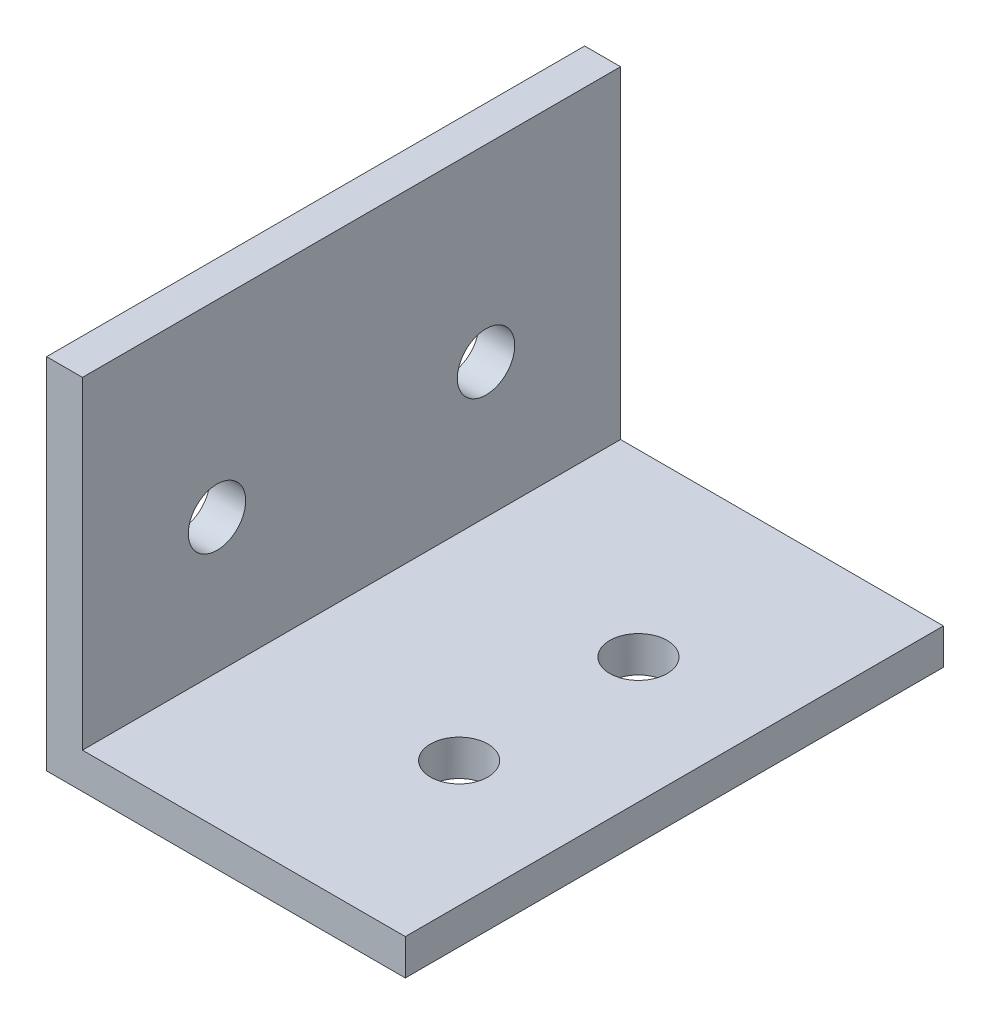
ISO-10303-21;
HEADER;
FILE_DESCRIPTION(('STEP AP214'),'2;1');
FILE_NAME('part.step','',(''),(''),'','','');
FILE_SCHEMA(('AUTOMOTIVE_DESIGN { 1 0 10303 214 1 1 1 1 }'));
ENDSEC;
DATA;
#1=APPLICATION_CONTEXT('core data for automotive mechanical design processes');
#2=APPLICATION_PROTOCOL_DEFINITION('international standard','automotive_design',2000,#1);
#3=PRODUCT_CONTEXT('',#1,'mechanical');
#4=PRODUCT('Part','Part','',(#3));
#5=PRODUCT_RELATED_PRODUCT_CATEGORY('part','',(#4));
#6=PRODUCT_DEFINITION_FORMATION('','',#4);
#7=PRODUCT_DEFINITION_CONTEXT('part definition',#1,'design');
#8=PRODUCT_DEFINITION('design','',#6,#7);
#9=PRODUCT_DEFINITION_SHAPE('','',#8);
#10=(LENGTH_UNIT() NAMED_UNIT(*) SI_UNIT(.MILLI.,.METRE.));
#11=(NAMED_UNIT(*) PLANE_ANGLE_UNIT() SI_UNIT($,.RADIAN.));
#12=(NAMED_UNIT(*) SI_UNIT($,.STERADIAN.) SOLID_ANGLE_UNIT());
#13=UNCERTAINTY_MEASURE_WITH_UNIT(LENGTH_MEASURE(1.E-05),#10,'distance_accuracy_value','');
#14=(GEOMETRIC_REPRESENTATION_CONTEXT(3) GLOBAL_UNCERTAINTY_ASSIGNED_CONTEXT((#13)) GLOBAL_UNIT_ASSIGNED_CONTEXT((#10,
#11,#12)) REPRESENTATION_CONTEXT('',''));
#15=CARTESIAN_POINT('',(0.,0.,0.));
#16=DIRECTION('',(0.,0.,1.));
#17=DIRECTION('',(1.,0.,0.));
#18=AXIS2_PLACEMENT_3D('',#15,#16,#17);
#19=CARTESIAN_POINT('',(0.,20.,30.));
#20=DIRECTION('',(0.,-1.,0.));
#21=DIRECTION('',(0.,0.,-1.));
#22=AXIS2_PLACEMENT_3D('',#19,#20,#21);
#23=PLANE('',#22);
#24=DIRECTION('',(-1.,0.,0.));
#25=VECTOR('',#24,1.);
#26=CARTESIAN_POINT('',(0.,20.,0.));
#27=LINE('',#26,#25);
#28=CARTESIAN_POINT('',(2.,20.,0.));
#29=VERTEX_POINT('',#28);
#30=CARTESIAN_POINT('',(0.,20.,0.));
#31=VERTEX_POINT('',#30);
#32=EDGE_CURVE('E119',#29,#31,#27,.T.);
#33=ORIENTED_EDGE('',*,*,#32,.T.);
#34=DIRECTION('',(0.,0.,-1.));
#35=VECTOR('',#34,1.);
#36=CARTESIAN_POINT('',(0.,20.,30.));
#37=LINE('',#36,#35);
#38=CARTESIAN_POINT('',(0.,20.,30.));
#39=VERTEX_POINT('',#38);
#40=EDGE_CURVE('E11',#39,#31,#37,.T.);
#41=ORIENTED_EDGE('',*,*,#40,.F.);
#42=DIRECTION('',(-1.,0.,0.));
#43=VECTOR('',#42,1.);
#44=CARTESIAN_POINT('',(0.,20.,30.));
#45=LINE('',#44,#43);
#46=CARTESIAN_POINT('',(2.,20.,30.));
#47=VERTEX_POINT('',#46);
#48=EDGE_CURVE('E130',#47,#39,#45,.T.);
#49=ORIENTED_EDGE('',*,*,#48,.F.);
#50=DIRECTION('',(0.,0.,-1.));
#51=VECTOR('',#50,1.);
#52=CARTESIAN_POINT('',(2.,20.,30.));
#53=LINE('',#52,#51);
#54=EDGE_CURVE('E115',#47,#29,#53,.T.);
#55=ORIENTED_EDGE('',*,*,#54,.T.);
#56=EDGE_LOOP('',(#33,#41,#49,#55));
#57=FACE_BOUND('',#56,.T.);
#58=ADVANCED_FACE('F33',(#57),#23,.F.);
#59=CARTESIAN_POINT('',(0.,20.,30.));
#60=DIRECTION('',(1.,0.,0.));
#61=DIRECTION('',(0.,1.,0.));
#62=AXIS2_PLACEMENT_3D('',#59,#60,#61);
#63=PLANE('',#62);
#64=CARTESIAN_POINT('',(0.,9.5,7.5));
#65=DIRECTION('',(1.,0.,0.));
#66=DIRECTION('',(0.,0.,-1.));
#67=AXIS2_PLACEMENT_3D('',#64,#65,#66);
#68=CIRCLE('',#67,1.6);
#69=CARTESIAN_POINT('',(0.,9.5,5.9));
#70=VERTEX_POINT('',#69);
#71=EDGE_CURVE('E141',#70,#70,#68,.T.);
#72=ORIENTED_EDGE('',*,*,#71,.T.);
#73=EDGE_LOOP('',(#72));
#74=FACE_BOUND('',#73,.T.);
#75=CARTESIAN_POINT('',(0.,9.5,22.5));
#76=DIRECTION('',(1.,0.,0.));
#77=DIRECTION('',(0.,0.,-1.));
#78=AXIS2_PLACEMENT_3D('',#75,#76,#77);
#79=CIRCLE('',#78,1.6);
#80=CARTESIAN_POINT('',(0.,9.5,20.9));
#81=VERTEX_POINT('',#80);
#82=EDGE_CURVE('E138',#81,#81,#79,.T.);
#83=ORIENTED_EDGE('',*,*,#82,.T.);
#84=EDGE_LOOP('',(#83));
#85=FACE_BOUND('',#84,.T.);
#86=DIRECTION('',(0.,-1.,0.));
#87=VECTOR('',#86,1.);
#88=CARTESIAN_POINT('',(0.,20.,0.));
#89=LINE('',#88,#87);
#90=CARTESIAN_POINT('',(0.,0.,0.));
#91=VERTEX_POINT('',#90);
#92=EDGE_CURVE('E122',#31,#91,#89,.T.);
#93=ORIENTED_EDGE('',*,*,#92,.T.);
#94=DIRECTION('',(0.,0.,-1.));
#95=VECTOR('',#94,1.);
#96=CARTESIAN_POINT('',(0.,0.,30.));
#97=LINE('',#96,#95);
#98=CARTESIAN_POINT('',(0.,0.,30.));
#99=VERTEX_POINT('',#98);
#100=EDGE_CURVE('E42',#99,#91,#97,.T.);
#101=ORIENTED_EDGE('',*,*,#100,.F.);
#102=DIRECTION('',(0.,-1.,0.));
#103=VECTOR('',#102,1.);
#104=CARTESIAN_POINT('',(0.,20.,30.));
#105=LINE('',#104,#103);
#106=EDGE_CURVE('E88',#39,#99,#105,.T.);
#107=ORIENTED_EDGE('',*,*,#106,.F.);
#108=ORIENTED_EDGE('',*,*,#40,.T.);
#109=EDGE_LOOP('',(#93,#101,#107,#108));
#110=FACE_BOUND('',#109,.T.);
#111=ADVANCED_FACE('F162',(#74,#85,#110),#63,.F.);
#112=CARTESIAN_POINT('',(0.,0.,30.));
#113=DIRECTION('',(0.,1.,0.));
#114=DIRECTION('',(0.,0.,1.));
#115=AXIS2_PLACEMENT_3D('',#112,#113,#114);
#116=PLANE('',#115);
#117=CARTESIAN_POINT('',(13.,0.,20.));
#118=DIRECTION('',(0.,1.,0.));
#119=DIRECTION('',(0.,0.,1.));
#120=AXIS2_PLACEMENT_3D('',#117,#118,#119);
#121=CIRCLE('',#120,1.6);
#122=CARTESIAN_POINT('',(13.,0.,21.6));
#123=VERTEX_POINT('',#122);
#124=EDGE_CURVE('E154',#123,#123,#121,.T.);
#125=ORIENTED_EDGE('',*,*,#124,.T.);
#126=EDGE_LOOP('',(#125));
#127=FACE_BOUND('',#126,.T.);
#128=CARTESIAN_POINT('',(13.,0.,10.));
#129=DIRECTION('',(0.,1.,0.));
#130=DIRECTION('',(0.,0.,1.));
#131=AXIS2_PLACEMENT_3D('',#128,#129,#130);
#132=CIRCLE('',#131,1.6);
#133=CARTESIAN_POINT('',(13.,0.,11.6));
#134=VERTEX_POINT('',#133);
#135=EDGE_CURVE('E144',#134,#134,#132,.T.);
#136=ORIENTED_EDGE('',*,*,#135,.T.);
#137=EDGE_LOOP('',(#136));
#138=FACE_BOUND('',#137,.T.);
#139=DIRECTION('',(1.,0.,0.));
#140=VECTOR('',#139,1.);
#141=CARTESIAN_POINT('',(0.,0.,0.));
#142=LINE('',#141,#140);
#143=CARTESIAN_POINT('',(20.,0.,0.));
#144=VERTEX_POINT('',#143);
#145=EDGE_CURVE('E125',#91,#144,#142,.T.);
#146=ORIENTED_EDGE('',*,*,#145,.T.);
#147=DIRECTION('',(0.,0.,-1.));
#148=VECTOR('',#147,1.);
#149=CARTESIAN_POINT('',(20.,0.,30.));
#150=LINE('',#149,#148);
#151=CARTESIAN_POINT('',(20.,0.,30.));
#152=VERTEX_POINT('',#151);
#153=EDGE_CURVE('E110',#152,#144,#150,.T.);
#154=ORIENTED_EDGE('',*,*,#153,.F.);
#155=DIRECTION('',(1.,0.,0.));
#156=VECTOR('',#155,1.);
#157=CARTESIAN_POINT('',(0.,0.,30.));
#158=LINE('',#157,#156);
#159=EDGE_CURVE('E101',#99,#152,#158,.T.);
#160=ORIENTED_EDGE('',*,*,#159,.F.);
#161=ORIENTED_EDGE('',*,*,#100,.T.);
#162=EDGE_LOOP('',(#146,#154,#160,#161));
#163=FACE_BOUND('',#162,.T.);
#164=ADVANCED_FACE('F165',(#127,#138,#163),#116,.F.);
#165=CARTESIAN_POINT('',(20.,2.,30.));
#166=DIRECTION('',(-1.,0.,0.));
#167=DIRECTION('',(0.,0.,1.));
#168=AXIS2_PLACEMENT_3D('',#165,#166,#167);
#169=PLANE('',#168);
#170=DIRECTION('',(0.,1.,0.));
#171=VECTOR('',#170,1.);
#172=CARTESIAN_POINT('',(20.,2.,0.));
#173=LINE('',#172,#171);
#174=CARTESIAN_POINT('',(20.,2.,0.));
#175=VERTEX_POINT('',#174);
#176=EDGE_CURVE('E109',#144,#175,#173,.T.);
#177=ORIENTED_EDGE('',*,*,#176,.T.);
#178=DIRECTION('',(0.,0.,-1.));
#179=VECTOR('',#178,1.);
#180=CARTESIAN_POINT('',(20.,2.,30.));
#181=LINE('',#180,#179);
#182=CARTESIAN_POINT('',(20.,2.,30.));
#183=VERTEX_POINT('',#182);
#184=EDGE_CURVE('E106',#183,#175,#181,.T.);
#185=ORIENTED_EDGE('',*,*,#184,.F.);
#186=DIRECTION('',(0.,1.,0.));
#187=VECTOR('',#186,1.);
#188=CARTESIAN_POINT('',(20.,2.,30.));
#189=LINE('',#188,#187);
#190=EDGE_CURVE('E95',#152,#183,#189,.T.);
#191=ORIENTED_EDGE('',*,*,#190,.F.);
#192=ORIENTED_EDGE('',*,*,#153,.T.);
#193=EDGE_LOOP('',(#177,#185,#191,#192));
#194=FACE_BOUND('',#193,.T.);
#195=ADVANCED_FACE('F107',(#194),#169,.F.);
#196=CARTESIAN_POINT('',(2.,2.,30.));
#197=DIRECTION('',(0.,-1.,0.));
#198=DIRECTION('',(0.,0.,-1.));
#199=AXIS2_PLACEMENT_3D('',#196,#197,#198);
#200=PLANE('',#199);
#201=CARTESIAN_POINT('',(13.,2.,20.));
#202=DIRECTION('',(0.,-1.,0.));
#203=DIRECTION('',(0.,0.,-1.));
#204=AXIS2_PLACEMENT_3D('',#201,#202,#203);
#205=CIRCLE('',#204,1.6);
#206=CARTESIAN_POINT('',(13.,2.,18.4));
#207=VERTEX_POINT('',#206);
#208=EDGE_CURVE('E36',#207,#207,#205,.F.);
#209=ORIENTED_EDGE('',*,*,#208,.F.);
#210=EDGE_LOOP('',(#209));
#211=FACE_BOUND('',#210,.T.);
#212=CARTESIAN_POINT('',(13.,2.,10.));
#213=DIRECTION('',(0.,-1.,0.));
#214=DIRECTION('',(0.,0.,-1.));
#215=AXIS2_PLACEMENT_3D('',#212,#213,#214);
#216=CIRCLE('',#215,1.6);
#217=CARTESIAN_POINT('',(13.,2.,8.4));
#218=VERTEX_POINT('',#217);
#219=EDGE_CURVE('E142',#218,#218,#216,.F.);
#220=ORIENTED_EDGE('',*,*,#219,.F.);
#221=EDGE_LOOP('',(#220));
#222=FACE_BOUND('',#221,.T.);
#223=DIRECTION('',(-1.,0.,0.));
#224=VECTOR('',#223,1.);
#225=CARTESIAN_POINT('',(2.,2.,0.));
#226=LINE('',#225,#224);
#227=CARTESIAN_POINT('',(2.,2.,0.));
#228=VERTEX_POINT('',#227);
#229=EDGE_CURVE('E74',#175,#228,#226,.T.);
#230=ORIENTED_EDGE('',*,*,#229,.T.);
#231=DIRECTION('',(0.,0.,-1.));
#232=VECTOR('',#231,1.);
#233=CARTESIAN_POINT('',(2.,2.,30.));
#234=LINE('',#233,#232);
#235=CARTESIAN_POINT('',(2.,2.,30.));
#236=VERTEX_POINT('',#235);
#237=EDGE_CURVE('E111',#236,#228,#234,.T.);
#238=ORIENTED_EDGE('',*,*,#237,.F.);
#239=DIRECTION('',(-1.,0.,0.));
#240=VECTOR('',#239,1.);
#241=CARTESIAN_POINT('',(2.,2.,30.));
#242=LINE('',#241,#240);
#243=EDGE_CURVE('E99',#183,#236,#242,.T.);
#244=ORIENTED_EDGE('',*,*,#243,.F.);
#245=ORIENTED_EDGE('',*,*,#184,.T.);
#246=EDGE_LOOP('',(#230,#238,#244,#245));
#247=FACE_BOUND('',#246,.T.);
#248=ADVANCED_FACE('F113',(#211,#222,#247),#200,.F.);
#249=CARTESIAN_POINT('',(2.,20.,30.));
#250=DIRECTION('',(-1.,0.,0.));
#251=DIRECTION('',(0.,-1.,0.));
#252=AXIS2_PLACEMENT_3D('',#249,#250,#251);
#253=PLANE('',#252);
#254=CARTESIAN_POINT('',(2.,9.5,7.5));
#255=DIRECTION('',(-1.,0.,0.));
#256=DIRECTION('',(0.,-1.,0.));
#257=AXIS2_PLACEMENT_3D('',#254,#255,#256);
#258=CIRCLE('',#257,1.6);
#259=CARTESIAN_POINT('',(2.,7.9,7.5));
#260=VERTEX_POINT('',#259);
#261=EDGE_CURVE('E139',#260,#260,#258,.F.);
#262=ORIENTED_EDGE('',*,*,#261,.F.);
#263=EDGE_LOOP('',(#262));
#264=FACE_BOUND('',#263,.T.);
#265=CARTESIAN_POINT('',(2.,9.5,22.5));
#266=DIRECTION('',(-1.,0.,0.));
#267=DIRECTION('',(0.,-1.,0.));
#268=AXIS2_PLACEMENT_3D('',#265,#266,#267);
#269=CIRCLE('',#268,1.6);
#270=CARTESIAN_POINT('',(2.,7.9,22.5));
#271=VERTEX_POINT('',#270);
#272=EDGE_CURVE('E123',#271,#271,#269,.F.);
#273=ORIENTED_EDGE('',*,*,#272,.F.);
#274=EDGE_LOOP('',(#273));
#275=FACE_BOUND('',#274,.T.);
#276=DIRECTION('',(0.,1.,0.));
#277=VECTOR('',#276,1.);
#278=CARTESIAN_POINT('',(2.,20.,0.));
#279=LINE('',#278,#277);
#280=EDGE_CURVE('E80',#228,#29,#279,.T.);
#281=ORIENTED_EDGE('',*,*,#280,.T.);
#282=ORIENTED_EDGE('',*,*,#54,.F.);
#283=DIRECTION('',(0.,1.,0.));
#284=VECTOR('',#283,1.);
#285=CARTESIAN_POINT('',(2.,20.,30.));
#286=LINE('',#285,#284);
#287=EDGE_CURVE('E51',#236,#47,#286,.T.);
#288=ORIENTED_EDGE('',*,*,#287,.F.);
#289=ORIENTED_EDGE('',*,*,#237,.T.);
#290=EDGE_LOOP('',(#281,#282,#288,#289));
#291=FACE_BOUND('',#290,.T.);
#292=ADVANCED_FACE('F170',(#264,#275,#291),#253,.F.);
#293=CARTESIAN_POINT('',(0.,0.,30.));
#294=DIRECTION('',(0.,0.,-1.));
#295=DIRECTION('',(-1.,0.,0.));
#296=AXIS2_PLACEMENT_3D('',#293,#294,#295);
#297=PLANE('',#296);
#298=ORIENTED_EDGE('',*,*,#48,.T.);
#299=ORIENTED_EDGE('',*,*,#106,.T.);
#300=ORIENTED_EDGE('',*,*,#159,.T.);
#301=ORIENTED_EDGE('',*,*,#190,.T.);
#302=ORIENTED_EDGE('',*,*,#243,.T.);
#303=ORIENTED_EDGE('',*,*,#287,.T.);
#304=EDGE_LOOP('',(#298,#299,#300,#301,#302,#303));
#305=FACE_BOUND('',#304,.T.);
#306=ADVANCED_FACE('F97',(#305),#297,.F.);
#307=CARTESIAN_POINT('',(0.,0.,0.));
#308=DIRECTION('',(0.,0.,-1.));
#309=DIRECTION('',(-1.,0.,0.));
#310=AXIS2_PLACEMENT_3D('',#307,#308,#309);
#311=PLANE('',#310);
#312=ORIENTED_EDGE('',*,*,#32,.F.);
#313=ORIENTED_EDGE('',*,*,#280,.F.);
#314=ORIENTED_EDGE('',*,*,#229,.F.);
#315=ORIENTED_EDGE('',*,*,#176,.F.);
#316=ORIENTED_EDGE('',*,*,#145,.F.);
#317=ORIENTED_EDGE('',*,*,#92,.F.);
#318=EDGE_LOOP('',(#312,#313,#314,#315,#316,#317));
#319=FACE_BOUND('',#318,.T.);
#320=ADVANCED_FACE('F168',(#319),#311,.T.);
#321=CARTESIAN_POINT('',(10.,9.5,22.5));
#322=DIRECTION('',(-1.,0.,0.));
#323=DIRECTION('',(0.,0.,1.));
#324=AXIS2_PLACEMENT_3D('',#321,#322,#323);
#325=CYLINDRICAL_SURFACE('',#324,1.6);
#326=ORIENTED_EDGE('',*,*,#82,.F.);
#327=EDGE_LOOP('',(#326));
#328=FACE_BOUND('',#327,.T.);
#329=ORIENTED_EDGE('',*,*,#272,.T.);
#330=EDGE_LOOP('',(#329));
#331=FACE_BOUND('',#330,.T.);
#332=ADVANCED_FACE('F241',(#328,#331),#325,.F.);
#333=CARTESIAN_POINT('',(10.,9.5,7.5));
#334=DIRECTION('',(-1.,0.,0.));
#335=DIRECTION('',(0.,0.,1.));
#336=AXIS2_PLACEMENT_3D('',#333,#334,#335);
#337=CYLINDRICAL_SURFACE('',#336,1.6);
#338=ORIENTED_EDGE('',*,*,#71,.F.);
#339=EDGE_LOOP('',(#338));
#340=FACE_BOUND('',#339,.T.);
#341=ORIENTED_EDGE('',*,*,#261,.T.);
#342=EDGE_LOOP('',(#341));
#343=FACE_BOUND('',#342,.T.);
#344=ADVANCED_FACE('F221',(#340,#343),#337,.F.);
#345=CARTESIAN_POINT('',(13.,4.,10.));
#346=DIRECTION('',(0.,-1.,0.));
#347=DIRECTION('',(0.,0.,-1.));
#348=AXIS2_PLACEMENT_3D('',#345,#346,#347);
#349=CYLINDRICAL_SURFACE('',#348,1.6);
#350=ORIENTED_EDGE('',*,*,#135,.F.);
#351=EDGE_LOOP('',(#350));
#352=FACE_BOUND('',#351,.T.);
#353=ORIENTED_EDGE('',*,*,#219,.T.);
#354=EDGE_LOOP('',(#353));
#355=FACE_BOUND('',#354,.T.);
#356=ADVANCED_FACE('F215',(#352,#355),#349,.F.);
#357=CARTESIAN_POINT('',(13.,4.,20.));
#358=DIRECTION('',(0.,-1.,0.));
#359=DIRECTION('',(0.,0.,-1.));
#360=AXIS2_PLACEMENT_3D('',#357,#358,#359);
#361=CYLINDRICAL_SURFACE('',#360,1.6);
#362=ORIENTED_EDGE('',*,*,#124,.F.);
#363=EDGE_LOOP('',(#362));
#364=FACE_BOUND('',#363,.T.);
#365=ORIENTED_EDGE('',*,*,#208,.T.);
#366=EDGE_LOOP('',(#365));
#367=FACE_BOUND('',#366,.T.);
#368=ADVANCED_FACE('F220',(#364,#367),#361,.F.);
#369=CLOSED_SHELL('',(#58,#111,#164,#195,#248,#292,#306,#320,#332,#344,#356,#368));
#370=MANIFOLD_SOLID_BREP('B2',#369);
#371=ADVANCED_BREP_SHAPE_REPRESENTATION('',(#18,#370),#14);
#372=SHAPE_DEFINITION_REPRESENTATION(#9,#371);
ENDSEC;
END-ISO-10303-21;
